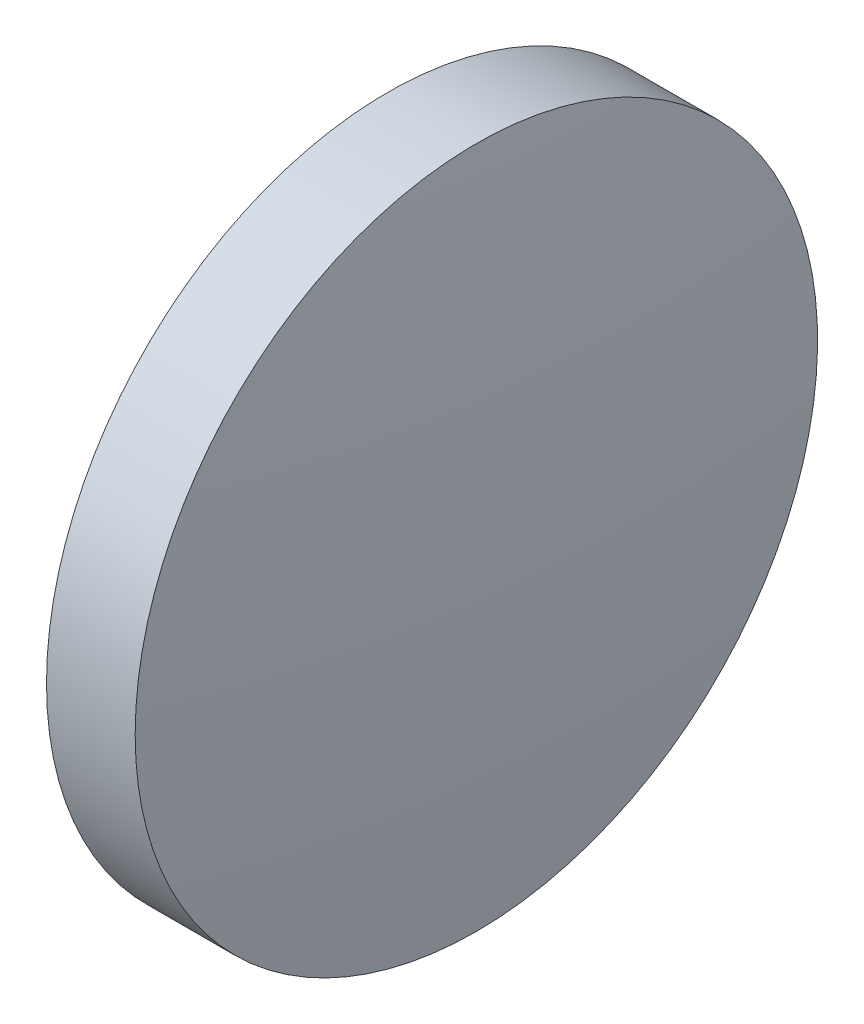
ISO-10303-21;
HEADER;
FILE_DESCRIPTION(('STEP AP214'),'2;1');
FILE_NAME('part.step','',(''),(''),'','','');
FILE_SCHEMA(('AUTOMOTIVE_DESIGN { 1 0 10303 214 1 1 1 1 }'));
ENDSEC;
DATA;
#1=APPLICATION_CONTEXT('core data for automotive mechanical design processes');
#2=APPLICATION_PROTOCOL_DEFINITION('international standard','automotive_design',2000,#1);
#3=PRODUCT_CONTEXT('',#1,'mechanical');
#4=PRODUCT('Part','Part','',(#3));
#5=PRODUCT_RELATED_PRODUCT_CATEGORY('part','',(#4));
#6=PRODUCT_DEFINITION_FORMATION('','',#4);
#7=PRODUCT_DEFINITION_CONTEXT('part definition',#1,'design');
#8=PRODUCT_DEFINITION('design','',#6,#7);
#9=PRODUCT_DEFINITION_SHAPE('','',#8);
#10=(LENGTH_UNIT() NAMED_UNIT(*) SI_UNIT(.MILLI.,.METRE.));
#11=(NAMED_UNIT(*) PLANE_ANGLE_UNIT() SI_UNIT($,.RADIAN.));
#12=(NAMED_UNIT(*) SI_UNIT($,.STERADIAN.) SOLID_ANGLE_UNIT());
#13=UNCERTAINTY_MEASURE_WITH_UNIT(LENGTH_MEASURE(1.E-05),#10,'distance_accuracy_value','');
#14=(GEOMETRIC_REPRESENTATION_CONTEXT(3) GLOBAL_UNCERTAINTY_ASSIGNED_CONTEXT((#13)) GLOBAL_UNIT_ASSIGNED_CONTEXT((#10,
#11,#12)) REPRESENTATION_CONTEXT('',''));
#15=CARTESIAN_POINT('',(0.,0.,0.));
#16=DIRECTION('',(0.,0.,1.));
#17=DIRECTION('',(1.,0.,0.));
#18=AXIS2_PLACEMENT_3D('',#15,#16,#17);
#19=CARTESIAN_POINT('',(268.749762076762,118.350248118989,0.));
#20=DIRECTION('',(-1.,0.,0.));
#21=DIRECTION('',(0.,-1.,0.));
#22=AXIS2_PLACEMENT_3D('',#19,#20,#21);
#23=SPHERICAL_SURFACE('',#22,115.557142857141);
#24=CARTESIAN_POINT('',(383.606904933904,118.350248118989,0.));
#25=DIRECTION('',(-1.,0.,0.));
#26=DIRECTION('',(0.,0.,1.));
#27=AXIS2_PLACEMENT_3D('',#24,#25,#26);
#28=CIRCLE('',#27,12.7);
#29=CARTESIAN_POINT('',(383.606904933904,118.350248118989,12.7));
#30=VERTEX_POINT('',#29);
#31=EDGE_CURVE('E10',#30,#30,#28,.T.);
#32=ORIENTED_EDGE('',*,*,#31,.F.);
#33=EDGE_LOOP('',(#32));
#34=FACE_BOUND('',#33,.T.);
#35=ADVANCED_FACE('F35',(#34),#23,.T.);
#36=CARTESIAN_POINT('',(374.677008882747,118.350248118989,0.));
#37=DIRECTION('',(-1.,0.,0.));
#38=DIRECTION('',(0.,0.,1.));
#39=AXIS2_PLACEMENT_3D('',#36,#37,#38);
#40=CYLINDRICAL_SURFACE('',#39,12.7);
#41=CARTESIAN_POINT('',(380.306904933904,118.350248118989,0.));
#42=DIRECTION('',(-1.,0.,0.));
#43=DIRECTION('',(0.,0.,1.));
#44=AXIS2_PLACEMENT_3D('',#41,#42,#43);
#45=CIRCLE('',#44,12.7);
#46=CARTESIAN_POINT('',(380.306904933904,118.350248118989,12.7));
#47=VERTEX_POINT('',#46);
#48=EDGE_CURVE('E41',#47,#47,#45,.T.);
#49=ORIENTED_EDGE('',*,*,#48,.F.);
#50=EDGE_LOOP('',(#49));
#51=FACE_BOUND('',#50,.T.);
#52=ORIENTED_EDGE('',*,*,#31,.T.);
#53=EDGE_LOOP('',(#52));
#54=FACE_BOUND('',#53,.T.);
#55=ADVANCED_FACE('F49',(#51,#54),#40,.T.);
#56=CARTESIAN_POINT('',(380.306904933904,118.350248118989,0.));
#57=DIRECTION('',(1.,0.,0.));
#58=DIRECTION('',(0.,0.,-1.));
#59=AXIS2_PLACEMENT_3D('',#56,#57,#58);
#60=PLANE('',#59);
#61=ORIENTED_EDGE('',*,*,#48,.T.);
#62=EDGE_LOOP('',(#61));
#63=FACE_BOUND('',#62,.T.);
#64=ADVANCED_FACE('F47',(#63),#60,.F.);
#65=CLOSED_SHELL('',(#35,#55,#64));
#66=MANIFOLD_SOLID_BREP('B2',#65);
#67=ADVANCED_BREP_SHAPE_REPRESENTATION('',(#18,#66),#14);
#68=SHAPE_DEFINITION_REPRESENTATION(#9,#67);
ENDSEC;
END-ISO-10303-21;
